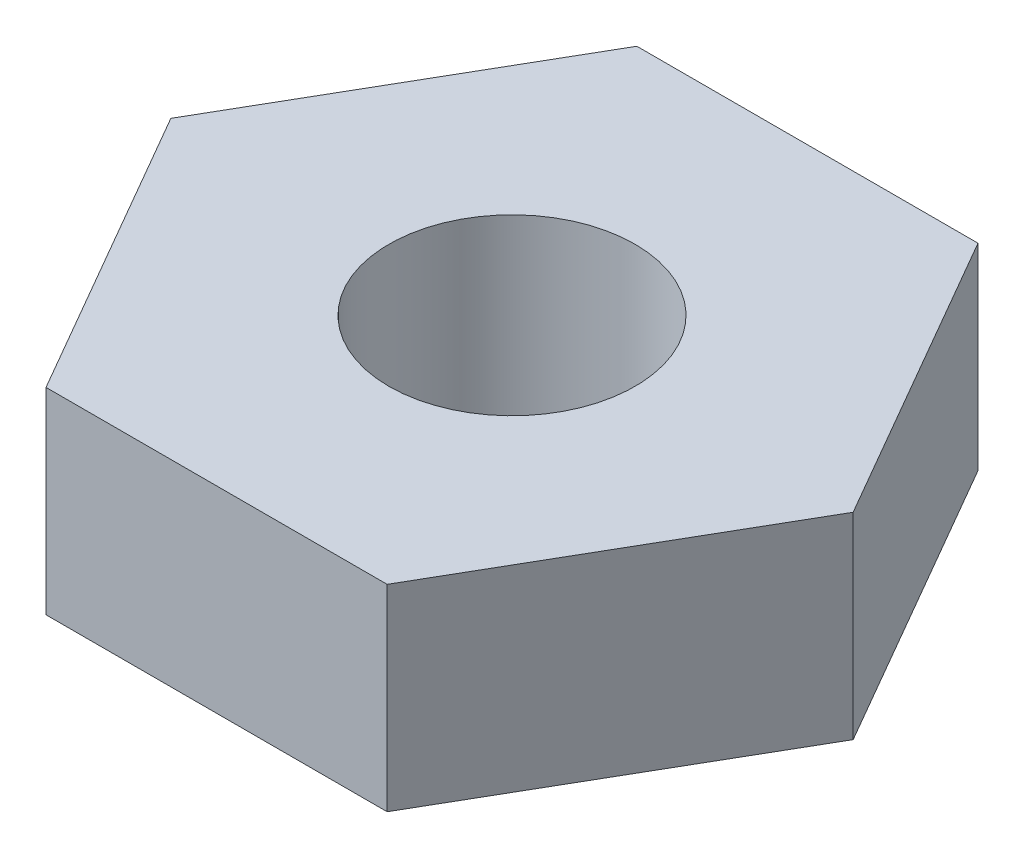
ISO-10303-21;
HEADER;
FILE_DESCRIPTION(('STEP AP214'),'2;1');
FILE_NAME('part.step','',(''),(''),'','','');
FILE_SCHEMA(('AUTOMOTIVE_DESIGN { 1 0 10303 214 1 1 1 1 }'));
ENDSEC;
DATA;
#1=APPLICATION_CONTEXT('core data for automotive mechanical design processes');
#2=APPLICATION_PROTOCOL_DEFINITION('international standard','automotive_design',2000,#1);
#3=PRODUCT_CONTEXT('',#1,'mechanical');
#4=PRODUCT('Part','Part','',(#3));
#5=PRODUCT_RELATED_PRODUCT_CATEGORY('part','',(#4));
#6=PRODUCT_DEFINITION_FORMATION('','',#4);
#7=PRODUCT_DEFINITION_CONTEXT('part definition',#1,'design');
#8=PRODUCT_DEFINITION('design','',#6,#7);
#9=PRODUCT_DEFINITION_SHAPE('','',#8);
#10=(LENGTH_UNIT() NAMED_UNIT(*) SI_UNIT(.MILLI.,.METRE.));
#11=(NAMED_UNIT(*) PLANE_ANGLE_UNIT() SI_UNIT($,.RADIAN.));
#12=(NAMED_UNIT(*) SI_UNIT($,.STERADIAN.) SOLID_ANGLE_UNIT());
#13=UNCERTAINTY_MEASURE_WITH_UNIT(LENGTH_MEASURE(1.E-05),#10,'distance_accuracy_value','');
#14=(GEOMETRIC_REPRESENTATION_CONTEXT(3) GLOBAL_UNCERTAINTY_ASSIGNED_CONTEXT((#13)) GLOBAL_UNIT_ASSIGNED_CONTEXT((#10,
#11,#12)) REPRESENTATION_CONTEXT('',''));
#15=CARTESIAN_POINT('',(0.,0.,0.));
#16=DIRECTION('',(0.,0.,1.));
#17=DIRECTION('',(1.,0.,0.));
#18=AXIS2_PLACEMENT_3D('',#15,#16,#17);
#19=CARTESIAN_POINT('',(2.7712812921102,1.6,0.));
#20=DIRECTION('',(0.,1.,0.));
#21=DIRECTION('',(0.,0.,1.));
#22=AXIS2_PLACEMENT_3D('',#19,#20,#21);
#23=PLANE('',#22);
#24=DIRECTION('',(0.499999999999999,0.,-0.866025403784439));
#25=VECTOR('',#24,1.);
#26=CARTESIAN_POINT('',(1.3856406460551,1.6,2.4));
#27=LINE('',#26,#25);
#28=CARTESIAN_POINT('',(1.3856406460551,1.6,2.4));
#29=VERTEX_POINT('',#28);
#30=CARTESIAN_POINT('',(2.7712812921102,1.6,0.));
#31=VERTEX_POINT('',#30);
#32=EDGE_CURVE('E128',#29,#31,#27,.T.);
#33=ORIENTED_EDGE('',*,*,#32,.T.);
#34=DIRECTION('',(-0.5,0.,-0.866025403784439));
#35=VECTOR('',#34,1.);
#36=CARTESIAN_POINT('',(2.7712812921102,1.6,0.));
#37=LINE('',#36,#35);
#38=CARTESIAN_POINT('',(1.3856406460551,1.6,-2.40000000000001));
#39=VERTEX_POINT('',#38);
#40=EDGE_CURVE('E86',#31,#39,#37,.T.);
#41=ORIENTED_EDGE('',*,*,#40,.T.);
#42=DIRECTION('',(-1.,0.,0.));
#43=VECTOR('',#42,1.);
#44=CARTESIAN_POINT('',(1.3856406460551,1.6,-2.40000000000001));
#45=LINE('',#44,#43);
#46=CARTESIAN_POINT('',(-1.3856406460551,1.6,-2.40000000000001));
#47=VERTEX_POINT('',#46);
#48=EDGE_CURVE('E99',#39,#47,#45,.T.);
#49=ORIENTED_EDGE('',*,*,#48,.T.);
#50=DIRECTION('',(-0.5,0.,0.866025403784438));
#51=VECTOR('',#50,1.);
#52=CARTESIAN_POINT('',(-1.3856406460551,1.6,-2.40000000000001));
#53=LINE('',#52,#51);
#54=CARTESIAN_POINT('',(-2.77128129211021,1.6,0.));
#55=VERTEX_POINT('',#54);
#56=EDGE_CURVE('E93',#47,#55,#53,.T.);
#57=ORIENTED_EDGE('',*,*,#56,.T.);
#58=DIRECTION('',(0.500000000000001,0.,0.866025403784438));
#59=VECTOR('',#58,1.);
#60=CARTESIAN_POINT('',(-2.77128129211021,1.6,0.));
#61=LINE('',#60,#59);
#62=CARTESIAN_POINT('',(-1.3856406460551,1.6,2.4));
#63=VERTEX_POINT('',#62);
#64=EDGE_CURVE('E97',#55,#63,#61,.T.);
#65=ORIENTED_EDGE('',*,*,#64,.T.);
#66=DIRECTION('',(1.,0.,0.));
#67=VECTOR('',#66,1.);
#68=CARTESIAN_POINT('',(-1.3856406460551,1.6,2.4));
#69=LINE('',#68,#67);
#70=EDGE_CURVE('E49',#63,#29,#69,.T.);
#71=ORIENTED_EDGE('',*,*,#70,.T.);
#72=EDGE_LOOP('',(#33,#41,#49,#57,#65,#71));
#73=FACE_BOUND('',#72,.T.);
#74=CARTESIAN_POINT('',(0.,1.6,0.));
#75=DIRECTION('',(0.,1.,0.));
#76=DIRECTION('',(0.,0.,1.));
#77=AXIS2_PLACEMENT_3D('',#74,#75,#76);
#78=CIRCLE('',#77,1.);
#79=CARTESIAN_POINT('',(0.,1.6,1.));
#80=VERTEX_POINT('',#79);
#81=EDGE_CURVE('E121',#80,#80,#78,.T.);
#82=ORIENTED_EDGE('',*,*,#81,.F.);
#83=EDGE_LOOP('',(#82));
#84=FACE_BOUND('',#83,.T.);
#85=ADVANCED_FACE('F32',(#73,#84),#23,.T.);
#86=CARTESIAN_POINT('',(2.7712812921102,0.,0.));
#87=DIRECTION('',(0.,1.,0.));
#88=DIRECTION('',(0.,0.,1.));
#89=AXIS2_PLACEMENT_3D('',#86,#87,#88);
#90=PLANE('',#89);
#91=DIRECTION('',(0.499999999999999,0.,-0.866025403784439));
#92=VECTOR('',#91,1.);
#93=CARTESIAN_POINT('',(1.3856406460551,0.,2.4));
#94=LINE('',#93,#92);
#95=CARTESIAN_POINT('',(1.3856406460551,0.,2.4));
#96=VERTEX_POINT('',#95);
#97=CARTESIAN_POINT('',(2.7712812921102,0.,0.));
#98=VERTEX_POINT('',#97);
#99=EDGE_CURVE('E117',#96,#98,#94,.T.);
#100=ORIENTED_EDGE('',*,*,#99,.F.);
#101=DIRECTION('',(1.,0.,0.));
#102=VECTOR('',#101,1.);
#103=CARTESIAN_POINT('',(-1.3856406460551,0.,2.4));
#104=LINE('',#103,#102);
#105=CARTESIAN_POINT('',(-1.3856406460551,0.,2.4));
#106=VERTEX_POINT('',#105);
#107=EDGE_CURVE('E78',#106,#96,#104,.T.);
#108=ORIENTED_EDGE('',*,*,#107,.F.);
#109=DIRECTION('',(0.500000000000001,0.,0.866025403784438));
#110=VECTOR('',#109,1.);
#111=CARTESIAN_POINT('',(-2.77128129211021,0.,0.));
#112=LINE('',#111,#110);
#113=CARTESIAN_POINT('',(-2.77128129211021,0.,0.));
#114=VERTEX_POINT('',#113);
#115=EDGE_CURVE('E72',#114,#106,#112,.T.);
#116=ORIENTED_EDGE('',*,*,#115,.F.);
#117=DIRECTION('',(-0.5,0.,0.866025403784438));
#118=VECTOR('',#117,1.);
#119=CARTESIAN_POINT('',(-1.3856406460551,0.,-2.40000000000001));
#120=LINE('',#119,#118);
#121=CARTESIAN_POINT('',(-1.3856406460551,0.,-2.40000000000001));
#122=VERTEX_POINT('',#121);
#123=EDGE_CURVE('E107',#122,#114,#120,.T.);
#124=ORIENTED_EDGE('',*,*,#123,.F.);
#125=DIRECTION('',(-1.,0.,0.));
#126=VECTOR('',#125,1.);
#127=CARTESIAN_POINT('',(1.3856406460551,0.,-2.40000000000001));
#128=LINE('',#127,#126);
#129=CARTESIAN_POINT('',(1.3856406460551,0.,-2.40000000000001));
#130=VERTEX_POINT('',#129);
#131=EDGE_CURVE('E123',#130,#122,#128,.T.);
#132=ORIENTED_EDGE('',*,*,#131,.F.);
#133=DIRECTION('',(-0.5,0.,-0.866025403784439));
#134=VECTOR('',#133,1.);
#135=CARTESIAN_POINT('',(2.7712812921102,0.,0.));
#136=LINE('',#135,#134);
#137=EDGE_CURVE('E120',#98,#130,#136,.T.);
#138=ORIENTED_EDGE('',*,*,#137,.F.);
#139=EDGE_LOOP('',(#100,#108,#116,#124,#132,#138));
#140=FACE_BOUND('',#139,.T.);
#141=CARTESIAN_POINT('',(0.,0.,0.));
#142=DIRECTION('',(0.,1.,0.));
#143=DIRECTION('',(0.,0.,1.));
#144=AXIS2_PLACEMENT_3D('',#141,#142,#143);
#145=CIRCLE('',#144,1.);
#146=CARTESIAN_POINT('',(0.,0.,1.));
#147=VERTEX_POINT('',#146);
#148=EDGE_CURVE('E221',#147,#147,#145,.T.);
#149=ORIENTED_EDGE('',*,*,#148,.T.);
#150=EDGE_LOOP('',(#149));
#151=FACE_BOUND('',#150,.T.);
#152=ADVANCED_FACE('F137',(#140,#151),#90,.F.);
#153=CARTESIAN_POINT('',(1.3856406460551,1.6,2.4));
#154=DIRECTION('',(-0.866025403784439,0.,-0.499999999999999));
#155=DIRECTION('',(-0.499999999999999,0.,0.866025403784439));
#156=AXIS2_PLACEMENT_3D('',#153,#154,#155);
#157=PLANE('',#156);
#158=ORIENTED_EDGE('',*,*,#99,.T.);
#159=DIRECTION('',(0.,-1.,0.));
#160=VECTOR('',#159,1.);
#161=CARTESIAN_POINT('',(2.7712812921102,1.6,0.));
#162=LINE('',#161,#160);
#163=EDGE_CURVE('E11',#31,#98,#162,.T.);
#164=ORIENTED_EDGE('',*,*,#163,.F.);
#165=ORIENTED_EDGE('',*,*,#32,.F.);
#166=DIRECTION('',(0.,-1.,0.));
#167=VECTOR('',#166,1.);
#168=CARTESIAN_POINT('',(1.3856406460551,1.6,2.4));
#169=LINE('',#168,#167);
#170=EDGE_CURVE('E113',#29,#96,#169,.T.);
#171=ORIENTED_EDGE('',*,*,#170,.T.);
#172=EDGE_LOOP('',(#158,#164,#165,#171));
#173=FACE_BOUND('',#172,.T.);
#174=ADVANCED_FACE('F34',(#173),#157,.F.);
#175=CARTESIAN_POINT('',(2.7712812921102,1.6,0.));
#176=DIRECTION('',(-0.866025403784439,0.,0.5));
#177=DIRECTION('',(0.5,0.,0.866025403784439));
#178=AXIS2_PLACEMENT_3D('',#175,#176,#177);
#179=PLANE('',#178);
#180=ORIENTED_EDGE('',*,*,#137,.T.);
#181=DIRECTION('',(0.,-1.,0.));
#182=VECTOR('',#181,1.);
#183=CARTESIAN_POINT('',(1.3856406460551,1.6,-2.40000000000001));
#184=LINE('',#183,#182);
#185=EDGE_CURVE('E41',#39,#130,#184,.T.);
#186=ORIENTED_EDGE('',*,*,#185,.F.);
#187=ORIENTED_EDGE('',*,*,#40,.F.);
#188=ORIENTED_EDGE('',*,*,#163,.T.);
#189=EDGE_LOOP('',(#180,#186,#187,#188));
#190=FACE_BOUND('',#189,.T.);
#191=ADVANCED_FACE('F162',(#190),#179,.F.);
#192=CARTESIAN_POINT('',(1.3856406460551,1.6,-2.40000000000001));
#193=DIRECTION('',(0.,0.,1.));
#194=DIRECTION('',(1.,0.,0.));
#195=AXIS2_PLACEMENT_3D('',#192,#193,#194);
#196=PLANE('',#195);
#197=ORIENTED_EDGE('',*,*,#131,.T.);
#198=DIRECTION('',(0.,-1.,0.));
#199=VECTOR('',#198,1.);
#200=CARTESIAN_POINT('',(-1.3856406460551,1.6,-2.40000000000001));
#201=LINE('',#200,#199);
#202=EDGE_CURVE('E108',#47,#122,#201,.T.);
#203=ORIENTED_EDGE('',*,*,#202,.F.);
#204=ORIENTED_EDGE('',*,*,#48,.F.);
#205=ORIENTED_EDGE('',*,*,#185,.T.);
#206=EDGE_LOOP('',(#197,#203,#204,#205));
#207=FACE_BOUND('',#206,.T.);
#208=ADVANCED_FACE('F134',(#207),#196,.F.);
#209=CARTESIAN_POINT('',(-1.3856406460551,1.6,-2.40000000000001));
#210=DIRECTION('',(0.866025403784438,0.,0.5));
#211=DIRECTION('',(0.5,0.,-0.866025403784438));
#212=AXIS2_PLACEMENT_3D('',#209,#210,#211);
#213=PLANE('',#212);
#214=ORIENTED_EDGE('',*,*,#123,.T.);
#215=DIRECTION('',(0.,-1.,0.));
#216=VECTOR('',#215,1.);
#217=CARTESIAN_POINT('',(-2.77128129211021,1.6,0.));
#218=LINE('',#217,#216);
#219=EDGE_CURVE('E104',#55,#114,#218,.T.);
#220=ORIENTED_EDGE('',*,*,#219,.F.);
#221=ORIENTED_EDGE('',*,*,#56,.F.);
#222=ORIENTED_EDGE('',*,*,#202,.T.);
#223=EDGE_LOOP('',(#214,#220,#221,#222));
#224=FACE_BOUND('',#223,.T.);
#225=ADVANCED_FACE('F105',(#224),#213,.F.);
#226=CARTESIAN_POINT('',(-2.77128129211021,1.6,0.));
#227=DIRECTION('',(0.866025403784438,0.,-0.500000000000001));
#228=DIRECTION('',(-0.500000000000001,0.,-0.866025403784438));
#229=AXIS2_PLACEMENT_3D('',#226,#227,#228);
#230=PLANE('',#229);
#231=ORIENTED_EDGE('',*,*,#115,.T.);
#232=DIRECTION('',(0.,-1.,0.));
#233=VECTOR('',#232,1.);
#234=CARTESIAN_POINT('',(-1.3856406460551,1.6,2.4));
#235=LINE('',#234,#233);
#236=EDGE_CURVE('E109',#63,#106,#235,.T.);
#237=ORIENTED_EDGE('',*,*,#236,.F.);
#238=ORIENTED_EDGE('',*,*,#64,.F.);
#239=ORIENTED_EDGE('',*,*,#219,.T.);
#240=EDGE_LOOP('',(#231,#237,#238,#239));
#241=FACE_BOUND('',#240,.T.);
#242=ADVANCED_FACE('F111',(#241),#230,.F.);
#243=CARTESIAN_POINT('',(-1.3856406460551,1.6,2.4));
#244=DIRECTION('',(0.,0.,-1.));
#245=DIRECTION('',(-1.,0.,0.));
#246=AXIS2_PLACEMENT_3D('',#243,#244,#245);
#247=PLANE('',#246);
#248=ORIENTED_EDGE('',*,*,#107,.T.);
#249=ORIENTED_EDGE('',*,*,#170,.F.);
#250=ORIENTED_EDGE('',*,*,#70,.F.);
#251=ORIENTED_EDGE('',*,*,#236,.T.);
#252=EDGE_LOOP('',(#248,#249,#250,#251));
#253=FACE_BOUND('',#252,.T.);
#254=ADVANCED_FACE('F142',(#253),#247,.F.);
#255=CARTESIAN_POINT('',(0.,1.6,0.));
#256=DIRECTION('',(0.,-1.,0.));
#257=DIRECTION('',(0.,0.,-1.));
#258=AXIS2_PLACEMENT_3D('',#255,#256,#257);
#259=CYLINDRICAL_SURFACE('',#258,1.);
#260=ORIENTED_EDGE('',*,*,#81,.T.);
#261=EDGE_LOOP('',(#260));
#262=FACE_BOUND('',#261,.T.);
#263=ORIENTED_EDGE('',*,*,#148,.F.);
#264=EDGE_LOOP('',(#263));
#265=FACE_BOUND('',#264,.T.);
#266=ADVANCED_FACE('F144',(#262,#265),#259,.F.);
#267=CLOSED_SHELL('',(#85,#152,#174,#191,#208,#225,#242,#254,#266));
#268=MANIFOLD_SOLID_BREP('B2',#267);
#269=ADVANCED_BREP_SHAPE_REPRESENTATION('',(#18,#268),#14);
#270=SHAPE_DEFINITION_REPRESENTATION(#9,#269);
ENDSEC;
END-ISO-10303-21;
